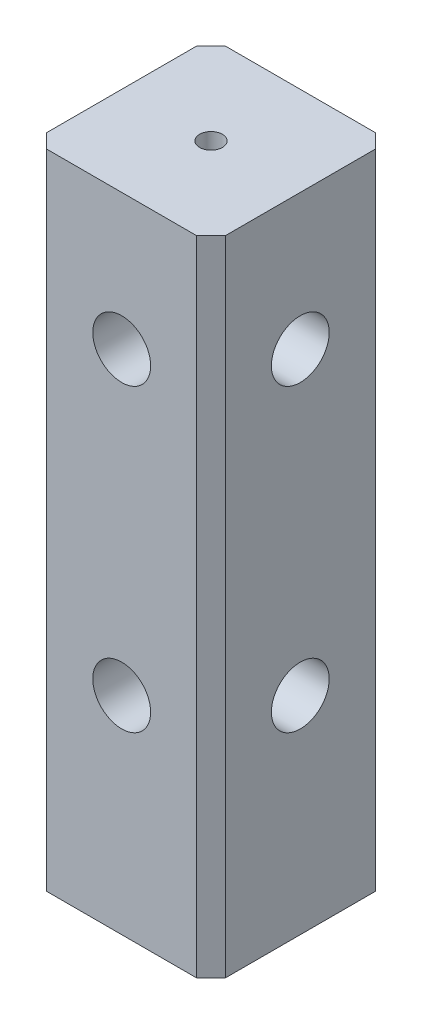
ISO-10303-21;
HEADER;
FILE_DESCRIPTION(('STEP AP214'),'2;1');
FILE_NAME('part.step','',(''),(''),'','','');
FILE_SCHEMA(('AUTOMOTIVE_DESIGN { 1 0 10303 214 1 1 1 1 }'));
ENDSEC;
DATA;
#1=APPLICATION_CONTEXT('core data for automotive mechanical design processes');
#2=APPLICATION_PROTOCOL_DEFINITION('international standard','automotive_design',2000,#1);
#3=PRODUCT_CONTEXT('',#1,'mechanical');
#4=PRODUCT('Part','Part','',(#3));
#5=PRODUCT_RELATED_PRODUCT_CATEGORY('part','',(#4));
#6=PRODUCT_DEFINITION_FORMATION('','',#4);
#7=PRODUCT_DEFINITION_CONTEXT('part definition',#1,'design');
#8=PRODUCT_DEFINITION('design','',#6,#7);
#9=PRODUCT_DEFINITION_SHAPE('','',#8);
#10=(LENGTH_UNIT() NAMED_UNIT(*) SI_UNIT(.MILLI.,.METRE.));
#11=(NAMED_UNIT(*) PLANE_ANGLE_UNIT() SI_UNIT($,.RADIAN.));
#12=(NAMED_UNIT(*) SI_UNIT($,.STERADIAN.) SOLID_ANGLE_UNIT());
#13=UNCERTAINTY_MEASURE_WITH_UNIT(LENGTH_MEASURE(1.E-05),#10,'distance_accuracy_value','');
#14=(GEOMETRIC_REPRESENTATION_CONTEXT(3) GLOBAL_UNCERTAINTY_ASSIGNED_CONTEXT((#13)) GLOBAL_UNIT_ASSIGNED_CONTEXT((#10,
#11,#12)) REPRESENTATION_CONTEXT('',''));
#15=CARTESIAN_POINT('',(0.,0.,0.));
#16=DIRECTION('',(0.,0.,1.));
#17=DIRECTION('',(1.,0.,0.));
#18=AXIS2_PLACEMENT_3D('',#15,#16,#17);
#19=CARTESIAN_POINT('',(12.5,90.,-12.5));
#20=DIRECTION('',(-1.,0.,0.));
#21=DIRECTION('',(0.,0.,1.));
#22=AXIS2_PLACEMENT_3D('',#19,#20,#21);
#23=PLANE('',#22);
#24=CARTESIAN_POINT('',(12.5,71.,0.));
#25=DIRECTION('',(1.,0.,0.));
#26=DIRECTION('',(0.,0.,-1.));
#27=AXIS2_PLACEMENT_3D('',#24,#25,#26);
#28=CIRCLE('',#27,4.05);
#29=CARTESIAN_POINT('',(12.5,71.,-4.05));
#30=VERTEX_POINT('',#29);
#31=EDGE_CURVE('E181',#30,#30,#28,.T.);
#32=ORIENTED_EDGE('',*,*,#31,.F.);
#33=EDGE_LOOP('',(#32));
#34=FACE_BOUND('',#33,.T.);
#35=CARTESIAN_POINT('',(12.5,29.,0.));
#36=DIRECTION('',(1.,0.,0.));
#37=DIRECTION('',(0.,0.,-1.));
#38=AXIS2_PLACEMENT_3D('',#35,#36,#37);
#39=CIRCLE('',#38,4.05);
#40=CARTESIAN_POINT('',(12.5,29.,-4.05));
#41=VERTEX_POINT('',#40);
#42=EDGE_CURVE('E133',#41,#41,#39,.T.);
#43=ORIENTED_EDGE('',*,*,#42,.F.);
#44=EDGE_LOOP('',(#43));
#45=FACE_BOUND('',#44,.T.);
#46=DIRECTION('',(0.,0.,-1.));
#47=VECTOR('',#46,1.);
#48=CARTESIAN_POINT('',(12.5,90.,-12.5));
#49=LINE('',#48,#47);
#50=CARTESIAN_POINT('',(12.5,90.,10.5));
#51=VERTEX_POINT('',#50);
#52=CARTESIAN_POINT('',(12.5,90.,-10.5));
#53=VERTEX_POINT('',#52);
#54=EDGE_CURVE('E120',#51,#53,#49,.T.);
#55=ORIENTED_EDGE('',*,*,#54,.F.);
#56=DIRECTION('',(0.,-1.,0.));
#57=VECTOR('',#56,1.);
#58=CARTESIAN_POINT('',(12.5,90.,10.5));
#59=LINE('',#58,#57);
#60=CARTESIAN_POINT('',(12.5,0.,10.5));
#61=VERTEX_POINT('',#60);
#62=EDGE_CURVE('E105',#51,#61,#59,.T.);
#63=ORIENTED_EDGE('',*,*,#62,.T.);
#64=DIRECTION('',(0.,0.,-1.));
#65=VECTOR('',#64,1.);
#66=CARTESIAN_POINT('',(12.5,0.,-12.5));
#67=LINE('',#66,#65);
#68=CARTESIAN_POINT('',(12.5,0.,-10.5));
#69=VERTEX_POINT('',#68);
#70=EDGE_CURVE('E117',#61,#69,#67,.T.);
#71=ORIENTED_EDGE('',*,*,#70,.T.);
#72=DIRECTION('',(0.,1.,0.));
#73=VECTOR('',#72,1.);
#74=CARTESIAN_POINT('',(12.5,90.,-10.5));
#75=LINE('',#74,#73);
#76=EDGE_CURVE('E122',#69,#53,#75,.T.);
#77=ORIENTED_EDGE('',*,*,#76,.T.);
#78=EDGE_LOOP('',(#55,#63,#71,#77));
#79=FACE_BOUND('',#78,.T.);
#80=ADVANCED_FACE('F35',(#34,#45,#79),#23,.F.);
#81=CARTESIAN_POINT('',(12.5,90.,-12.5));
#82=DIRECTION('',(0.,0.,1.));
#83=DIRECTION('',(1.,0.,0.));
#84=AXIS2_PLACEMENT_3D('',#81,#82,#83);
#85=PLANE('',#84);
#86=DIRECTION('',(-1.,0.,0.));
#87=VECTOR('',#86,1.);
#88=CARTESIAN_POINT('',(12.5,90.,-12.5));
#89=LINE('',#88,#87);
#90=CARTESIAN_POINT('',(10.5,90.,-12.5));
#91=VERTEX_POINT('',#90);
#92=CARTESIAN_POINT('',(-10.5,90.,-12.5));
#93=VERTEX_POINT('',#92);
#94=EDGE_CURVE('E166',#91,#93,#89,.T.);
#95=ORIENTED_EDGE('',*,*,#94,.F.);
#96=DIRECTION('',(0.,-1.,0.));
#97=VECTOR('',#96,1.);
#98=CARTESIAN_POINT('',(10.5,90.,-12.5));
#99=LINE('',#98,#97);
#100=CARTESIAN_POINT('',(10.5,0.,-12.5));
#101=VERTEX_POINT('',#100);
#102=EDGE_CURVE('E159',#91,#101,#99,.T.);
#103=ORIENTED_EDGE('',*,*,#102,.T.);
#104=DIRECTION('',(-1.,0.,0.));
#105=VECTOR('',#104,1.);
#106=CARTESIAN_POINT('',(12.5,0.,-12.5));
#107=LINE('',#106,#105);
#108=CARTESIAN_POINT('',(-10.5,0.,-12.5));
#109=VERTEX_POINT('',#108);
#110=EDGE_CURVE('E126',#101,#109,#107,.T.);
#111=ORIENTED_EDGE('',*,*,#110,.T.);
#112=DIRECTION('',(0.,1.,0.));
#113=VECTOR('',#112,1.);
#114=CARTESIAN_POINT('',(-10.5,90.,-12.5));
#115=LINE('',#114,#113);
#116=EDGE_CURVE('E157',#109,#93,#115,.T.);
#117=ORIENTED_EDGE('',*,*,#116,.T.);
#118=EDGE_LOOP('',(#95,#103,#111,#117));
#119=FACE_BOUND('',#118,.T.);
#120=ADVANCED_FACE('F164',(#119),#85,.F.);
#121=CARTESIAN_POINT('',(-12.5,90.,-12.5));
#122=DIRECTION('',(1.,0.,0.));
#123=DIRECTION('',(0.,0.,-1.));
#124=AXIS2_PLACEMENT_3D('',#121,#122,#123);
#125=PLANE('',#124);
#126=DIRECTION('',(0.,0.,1.));
#127=VECTOR('',#126,1.);
#128=CARTESIAN_POINT('',(-12.5,90.,-12.5));
#129=LINE('',#128,#127);
#130=CARTESIAN_POINT('',(-12.5,90.,-10.5));
#131=VERTEX_POINT('',#130);
#132=CARTESIAN_POINT('',(-12.5,90.,10.5));
#133=VERTEX_POINT('',#132);
#134=EDGE_CURVE('E174',#131,#133,#129,.T.);
#135=ORIENTED_EDGE('',*,*,#134,.F.);
#136=DIRECTION('',(0.,-1.,0.));
#137=VECTOR('',#136,1.);
#138=CARTESIAN_POINT('',(-12.5,90.,-10.5));
#139=LINE('',#138,#137);
#140=CARTESIAN_POINT('',(-12.5,0.,-10.5));
#141=VERTEX_POINT('',#140);
#142=EDGE_CURVE('E11',#131,#141,#139,.T.);
#143=ORIENTED_EDGE('',*,*,#142,.T.);
#144=DIRECTION('',(0.,0.,1.));
#145=VECTOR('',#144,1.);
#146=CARTESIAN_POINT('',(-12.5,0.,-12.5));
#147=LINE('',#146,#145);
#148=CARTESIAN_POINT('',(-12.5,0.,10.5));
#149=VERTEX_POINT('',#148);
#150=EDGE_CURVE('E130',#141,#149,#147,.T.);
#151=ORIENTED_EDGE('',*,*,#150,.T.);
#152=DIRECTION('',(0.,1.,0.));
#153=VECTOR('',#152,1.);
#154=CARTESIAN_POINT('',(-12.5,90.,10.5));
#155=LINE('',#154,#153);
#156=EDGE_CURVE('E43',#149,#133,#155,.T.);
#157=ORIENTED_EDGE('',*,*,#156,.T.);
#158=EDGE_LOOP('',(#135,#143,#151,#157));
#159=FACE_BOUND('',#158,.T.);
#160=ADVANCED_FACE('F173',(#159),#125,.F.);
#161=CARTESIAN_POINT('',(12.5,90.,12.5));
#162=DIRECTION('',(0.,0.,-1.));
#163=DIRECTION('',(-1.,0.,0.));
#164=AXIS2_PLACEMENT_3D('',#161,#162,#163);
#165=PLANE('',#164);
#166=CARTESIAN_POINT('',(0.,71.,12.5));
#167=DIRECTION('',(0.,0.,1.));
#168=DIRECTION('',(1.,0.,0.));
#169=AXIS2_PLACEMENT_3D('',#166,#167,#168);
#170=CIRCLE('',#169,4.05);
#171=CARTESIAN_POINT('',(4.05,71.,12.5));
#172=VERTEX_POINT('',#171);
#173=EDGE_CURVE('E192',#172,#172,#170,.T.);
#174=ORIENTED_EDGE('',*,*,#173,.F.);
#175=EDGE_LOOP('',(#174));
#176=FACE_BOUND('',#175,.T.);
#177=CARTESIAN_POINT('',(0.,29.,12.5));
#178=DIRECTION('',(0.,0.,1.));
#179=DIRECTION('',(1.,0.,0.));
#180=AXIS2_PLACEMENT_3D('',#177,#178,#179);
#181=CIRCLE('',#180,4.05);
#182=CARTESIAN_POINT('',(4.05,29.,12.5));
#183=VERTEX_POINT('',#182);
#184=EDGE_CURVE('E189',#183,#183,#181,.T.);
#185=ORIENTED_EDGE('',*,*,#184,.F.);
#186=EDGE_LOOP('',(#185));
#187=FACE_BOUND('',#186,.T.);
#188=DIRECTION('',(1.,0.,0.));
#189=VECTOR('',#188,1.);
#190=CARTESIAN_POINT('',(12.5,0.,12.5));
#191=LINE('',#190,#189);
#192=CARTESIAN_POINT('',(-10.5,0.,12.5));
#193=VERTEX_POINT('',#192);
#194=CARTESIAN_POINT('',(10.5,0.,12.5));
#195=VERTEX_POINT('',#194);
#196=EDGE_CURVE('E140',#193,#195,#191,.T.);
#197=ORIENTED_EDGE('',*,*,#196,.T.);
#198=DIRECTION('',(0.,1.,0.));
#199=VECTOR('',#198,1.);
#200=CARTESIAN_POINT('',(10.5,90.,12.5));
#201=LINE('',#200,#199);
#202=CARTESIAN_POINT('',(10.5,90.,12.5));
#203=VERTEX_POINT('',#202);
#204=EDGE_CURVE('E106',#195,#203,#201,.T.);
#205=ORIENTED_EDGE('',*,*,#204,.T.);
#206=DIRECTION('',(1.,0.,0.));
#207=VECTOR('',#206,1.);
#208=CARTESIAN_POINT('',(12.5,90.,12.5));
#209=LINE('',#208,#207);
#210=CARTESIAN_POINT('',(-10.5,90.,12.5));
#211=VERTEX_POINT('',#210);
#212=EDGE_CURVE('E136',#211,#203,#209,.T.);
#213=ORIENTED_EDGE('',*,*,#212,.F.);
#214=DIRECTION('',(0.,-1.,0.));
#215=VECTOR('',#214,1.);
#216=CARTESIAN_POINT('',(-10.5,90.,12.5));
#217=LINE('',#216,#215);
#218=EDGE_CURVE('E111',#211,#193,#217,.T.);
#219=ORIENTED_EDGE('',*,*,#218,.T.);
#220=EDGE_LOOP('',(#197,#205,#213,#219));
#221=FACE_BOUND('',#220,.T.);
#222=ADVANCED_FACE('F217',(#176,#187,#221),#165,.F.);
#223=CARTESIAN_POINT('',(12.5,90.,12.5));
#224=DIRECTION('',(0.,-1.,0.));
#225=DIRECTION('',(0.,0.,-1.));
#226=AXIS2_PLACEMENT_3D('',#223,#224,#225);
#227=PLANE('',#226);
#228=CARTESIAN_POINT('',(0.,90.,0.));
#229=DIRECTION('',(0.,1.,0.));
#230=DIRECTION('',(0.,0.,1.));
#231=AXIS2_PLACEMENT_3D('',#228,#229,#230);
#232=CIRCLE('',#231,1.6);
#233=CARTESIAN_POINT('',(0.,90.,1.6));
#234=VERTEX_POINT('',#233);
#235=EDGE_CURVE('E201',#234,#234,#232,.T.);
#236=ORIENTED_EDGE('',*,*,#235,.F.);
#237=EDGE_LOOP('',(#236));
#238=FACE_BOUND('',#237,.T.);
#239=ORIENTED_EDGE('',*,*,#212,.T.);
#240=DIRECTION('',(-0.70710678118655,0.,0.707106781186545));
#241=VECTOR('',#240,1.);
#242=CARTESIAN_POINT('',(12.5,90.,10.5));
#243=LINE('',#242,#241);
#244=EDGE_CURVE('E155',#203,#51,#243,.F.);
#245=ORIENTED_EDGE('',*,*,#244,.T.);
#246=ORIENTED_EDGE('',*,*,#54,.T.);
#247=DIRECTION('',(0.707106781186545,0.,0.70710678118655));
#248=VECTOR('',#247,1.);
#249=CARTESIAN_POINT('',(10.5,90.,-12.5));
#250=LINE('',#249,#248);
#251=EDGE_CURVE('E153',#53,#91,#250,.F.);
#252=ORIENTED_EDGE('',*,*,#251,.T.);
#253=ORIENTED_EDGE('',*,*,#94,.T.);
#254=DIRECTION('',(0.707106781186551,0.,-0.707106781186544));
#255=VECTOR('',#254,1.);
#256=CARTESIAN_POINT('',(-12.5,90.,-10.5));
#257=LINE('',#256,#255);
#258=EDGE_CURVE('E56',#93,#131,#257,.F.);
#259=ORIENTED_EDGE('',*,*,#258,.T.);
#260=ORIENTED_EDGE('',*,*,#134,.T.);
#261=DIRECTION('',(-0.707106781186545,0.,-0.70710678118655));
#262=VECTOR('',#261,1.);
#263=CARTESIAN_POINT('',(-10.5,90.,12.5));
#264=LINE('',#263,#262);
#265=EDGE_CURVE('E150',#133,#211,#264,.F.);
#266=ORIENTED_EDGE('',*,*,#265,.T.);
#267=EDGE_LOOP('',(#239,#245,#246,#252,#253,#259,#260,#266));
#268=FACE_BOUND('',#267,.T.);
#269=ADVANCED_FACE('F215',(#238,#268),#227,.F.);
#270=CARTESIAN_POINT('',(12.5,0.,12.5));
#271=DIRECTION('',(0.,-1.,0.));
#272=DIRECTION('',(0.,0.,-1.));
#273=AXIS2_PLACEMENT_3D('',#270,#271,#272);
#274=PLANE('',#273);
#275=ORIENTED_EDGE('',*,*,#70,.F.);
#276=DIRECTION('',(0.70710678118655,0.,-0.707106781186545));
#277=VECTOR('',#276,1.);
#278=CARTESIAN_POINT('',(11.5,0.,11.5));
#279=LINE('',#278,#277);
#280=EDGE_CURVE('E101',#61,#195,#279,.F.);
#281=ORIENTED_EDGE('',*,*,#280,.T.);
#282=ORIENTED_EDGE('',*,*,#196,.F.);
#283=DIRECTION('',(0.707106781186545,0.,0.70710678118655));
#284=VECTOR('',#283,1.);
#285=CARTESIAN_POINT('',(0.999999999999912,0.,24.));
#286=LINE('',#285,#284);
#287=EDGE_CURVE('E121',#193,#149,#286,.F.);
#288=ORIENTED_EDGE('',*,*,#287,.T.);
#289=ORIENTED_EDGE('',*,*,#150,.F.);
#290=DIRECTION('',(-0.707106781186551,0.,0.707106781186544));
#291=VECTOR('',#290,1.);
#292=CARTESIAN_POINT('',(-11.4999999999999,0.,-11.5000000000001));
#293=LINE('',#292,#291);
#294=EDGE_CURVE('E144',#141,#109,#293,.F.);
#295=ORIENTED_EDGE('',*,*,#294,.T.);
#296=ORIENTED_EDGE('',*,*,#110,.F.);
#297=DIRECTION('',(-0.707106781186545,0.,-0.70710678118655));
#298=VECTOR('',#297,1.);
#299=CARTESIAN_POINT('',(24.,0.,1.00000000000007));
#300=LINE('',#299,#298);
#301=EDGE_CURVE('E112',#101,#69,#300,.F.);
#302=ORIENTED_EDGE('',*,*,#301,.T.);
#303=EDGE_LOOP('',(#275,#281,#282,#288,#289,#295,#296,#302));
#304=FACE_BOUND('',#303,.T.);
#305=ADVANCED_FACE('F124',(#304),#274,.T.);
#306=CARTESIAN_POINT('',(4.5,29.,0.));
#307=DIRECTION('',(1.,0.,0.));
#308=DIRECTION('',(0.,0.,-1.));
#309=AXIS2_PLACEMENT_3D('',#306,#307,#308);
#310=CYLINDRICAL_SURFACE('',#309,4.05);
#311=CARTESIAN_POINT('',(4.5,29.,0.));
#312=DIRECTION('',(1.,0.,0.));
#313=DIRECTION('',(0.,0.,-1.));
#314=AXIS2_PLACEMENT_3D('',#311,#312,#313);
#315=CIRCLE('',#314,4.05);
#316=CARTESIAN_POINT('',(4.5,29.,-4.05));
#317=VERTEX_POINT('',#316);
#318=EDGE_CURVE('E127',#317,#317,#315,.T.);
#319=ORIENTED_EDGE('',*,*,#318,.F.);
#320=EDGE_LOOP('',(#319));
#321=FACE_BOUND('',#320,.T.);
#322=ORIENTED_EDGE('',*,*,#42,.T.);
#323=EDGE_LOOP('',(#322));
#324=FACE_BOUND('',#323,.T.);
#325=ADVANCED_FACE('F311',(#321,#324),#310,.F.);
#326=CARTESIAN_POINT('',(4.5,29.,0.));
#327=DIRECTION('',(1.,0.,0.));
#328=DIRECTION('',(0.,0.,-1.));
#329=AXIS2_PLACEMENT_3D('',#326,#327,#328);
#330=PLANE('',#329);
#331=ORIENTED_EDGE('',*,*,#318,.T.);
#332=EDGE_LOOP('',(#331));
#333=FACE_BOUND('',#332,.T.);
#334=ADVANCED_FACE('F304',(#333),#330,.T.);
#335=CARTESIAN_POINT('',(4.5,71.,0.));
#336=DIRECTION('',(1.,0.,0.));
#337=DIRECTION('',(0.,0.,-1.));
#338=AXIS2_PLACEMENT_3D('',#335,#336,#337);
#339=CYLINDRICAL_SURFACE('',#338,4.05);
#340=CARTESIAN_POINT('',(4.5,71.,0.));
#341=DIRECTION('',(1.,0.,0.));
#342=DIRECTION('',(0.,0.,-1.));
#343=AXIS2_PLACEMENT_3D('',#340,#341,#342);
#344=CIRCLE('',#343,4.05);
#345=CARTESIAN_POINT('',(4.5,71.,-4.04999999999999));
#346=VERTEX_POINT('',#345);
#347=EDGE_CURVE('E183',#346,#346,#344,.T.);
#348=ORIENTED_EDGE('',*,*,#347,.F.);
#349=EDGE_LOOP('',(#348));
#350=FACE_BOUND('',#349,.T.);
#351=ORIENTED_EDGE('',*,*,#31,.T.);
#352=EDGE_LOOP('',(#351));
#353=FACE_BOUND('',#352,.T.);
#354=ADVANCED_FACE('F301',(#350,#353),#339,.F.);
#355=CARTESIAN_POINT('',(4.5,71.,0.));
#356=DIRECTION('',(1.,0.,0.));
#357=DIRECTION('',(0.,0.,-1.));
#358=AXIS2_PLACEMENT_3D('',#355,#356,#357);
#359=PLANE('',#358);
#360=ORIENTED_EDGE('',*,*,#347,.T.);
#361=EDGE_LOOP('',(#360));
#362=FACE_BOUND('',#361,.T.);
#363=ADVANCED_FACE('F299',(#362),#359,.T.);
#364=CARTESIAN_POINT('',(0.,29.,4.5));
#365=DIRECTION('',(0.,0.,1.));
#366=DIRECTION('',(1.,0.,0.));
#367=AXIS2_PLACEMENT_3D('',#364,#365,#366);
#368=CYLINDRICAL_SURFACE('',#367,4.05);
#369=CARTESIAN_POINT('',(0.,29.,4.5));
#370=DIRECTION('',(0.,0.,1.));
#371=DIRECTION('',(1.,0.,0.));
#372=AXIS2_PLACEMENT_3D('',#369,#370,#371);
#373=CIRCLE('',#372,4.05);
#374=CARTESIAN_POINT('',(4.05,29.,4.5));
#375=VERTEX_POINT('',#374);
#376=EDGE_CURVE('E186',#375,#375,#373,.T.);
#377=ORIENTED_EDGE('',*,*,#376,.F.);
#378=EDGE_LOOP('',(#377));
#379=FACE_BOUND('',#378,.T.);
#380=ORIENTED_EDGE('',*,*,#184,.T.);
#381=EDGE_LOOP('',(#380));
#382=FACE_BOUND('',#381,.T.);
#383=ADVANCED_FACE('F295',(#379,#382),#368,.F.);
#384=CARTESIAN_POINT('',(0.,29.,4.5));
#385=DIRECTION('',(0.,0.,1.));
#386=DIRECTION('',(1.,0.,0.));
#387=AXIS2_PLACEMENT_3D('',#384,#385,#386);
#388=PLANE('',#387);
#389=ORIENTED_EDGE('',*,*,#376,.T.);
#390=EDGE_LOOP('',(#389));
#391=FACE_BOUND('',#390,.T.);
#392=ADVANCED_FACE('F289',(#391),#388,.T.);
#393=CARTESIAN_POINT('',(0.,71.,4.5));
#394=DIRECTION('',(0.,0.,1.));
#395=DIRECTION('',(1.,0.,0.));
#396=AXIS2_PLACEMENT_3D('',#393,#394,#395);
#397=CYLINDRICAL_SURFACE('',#396,4.05);
#398=CARTESIAN_POINT('',(0.,71.,4.5));
#399=DIRECTION('',(0.,0.,1.));
#400=DIRECTION('',(1.,0.,0.));
#401=AXIS2_PLACEMENT_3D('',#398,#399,#400);
#402=CIRCLE('',#401,4.05);
#403=CARTESIAN_POINT('',(4.05,71.,4.5));
#404=VERTEX_POINT('',#403);
#405=EDGE_CURVE('E195',#404,#404,#402,.T.);
#406=ORIENTED_EDGE('',*,*,#405,.F.);
#407=EDGE_LOOP('',(#406));
#408=FACE_BOUND('',#407,.T.);
#409=ORIENTED_EDGE('',*,*,#173,.T.);
#410=EDGE_LOOP('',(#409));
#411=FACE_BOUND('',#410,.T.);
#412=ADVANCED_FACE('F286',(#408,#411),#397,.F.);
#413=CARTESIAN_POINT('',(0.,71.,4.5));
#414=DIRECTION('',(0.,0.,1.));
#415=DIRECTION('',(1.,0.,0.));
#416=AXIS2_PLACEMENT_3D('',#413,#414,#415);
#417=PLANE('',#416);
#418=ORIENTED_EDGE('',*,*,#405,.T.);
#419=EDGE_LOOP('',(#418));
#420=FACE_BOUND('',#419,.T.);
#421=ADVANCED_FACE('F241',(#420),#417,.T.);
#422=CARTESIAN_POINT('',(12.5,90.,10.5));
#423=DIRECTION('',(-0.707106781186545,0.,-0.70710678118655));
#424=DIRECTION('',(-0.70710678118655,0.,0.707106781186545));
#425=AXIS2_PLACEMENT_3D('',#422,#423,#424);
#426=PLANE('',#425);
#427=ORIENTED_EDGE('',*,*,#244,.F.);
#428=ORIENTED_EDGE('',*,*,#204,.F.);
#429=ORIENTED_EDGE('',*,*,#280,.F.);
#430=ORIENTED_EDGE('',*,*,#62,.F.);
#431=EDGE_LOOP('',(#427,#428,#429,#430));
#432=FACE_BOUND('',#431,.T.);
#433=ADVANCED_FACE('F104',(#432),#426,.F.);
#434=CARTESIAN_POINT('',(10.5,90.,-12.5));
#435=DIRECTION('',(-0.70710678118655,0.,0.707106781186545));
#436=DIRECTION('',(0.707106781186545,0.,0.70710678118655));
#437=AXIS2_PLACEMENT_3D('',#434,#435,#436);
#438=PLANE('',#437);
#439=ORIENTED_EDGE('',*,*,#251,.F.);
#440=ORIENTED_EDGE('',*,*,#76,.F.);
#441=ORIENTED_EDGE('',*,*,#301,.F.);
#442=ORIENTED_EDGE('',*,*,#102,.F.);
#443=EDGE_LOOP('',(#439,#440,#441,#442));
#444=FACE_BOUND('',#443,.T.);
#445=ADVANCED_FACE('F227',(#444),#438,.F.);
#446=CARTESIAN_POINT('',(-12.5,90.,-10.5));
#447=DIRECTION('',(0.707106781186544,0.,0.707106781186551));
#448=DIRECTION('',(0.707106781186551,0.,-0.707106781186544));
#449=AXIS2_PLACEMENT_3D('',#446,#447,#448);
#450=PLANE('',#449);
#451=ORIENTED_EDGE('',*,*,#258,.F.);
#452=ORIENTED_EDGE('',*,*,#116,.F.);
#453=ORIENTED_EDGE('',*,*,#294,.F.);
#454=ORIENTED_EDGE('',*,*,#142,.F.);
#455=EDGE_LOOP('',(#451,#452,#453,#454));
#456=FACE_BOUND('',#455,.T.);
#457=ADVANCED_FACE('F172',(#456),#450,.F.);
#458=CARTESIAN_POINT('',(-10.5,90.,12.5));
#459=DIRECTION('',(0.70710678118655,0.,-0.707106781186545));
#460=DIRECTION('',(-0.707106781186545,0.,-0.70710678118655));
#461=AXIS2_PLACEMENT_3D('',#458,#459,#460);
#462=PLANE('',#461);
#463=ORIENTED_EDGE('',*,*,#265,.F.);
#464=ORIENTED_EDGE('',*,*,#156,.F.);
#465=ORIENTED_EDGE('',*,*,#287,.F.);
#466=ORIENTED_EDGE('',*,*,#218,.F.);
#467=EDGE_LOOP('',(#463,#464,#465,#466));
#468=FACE_BOUND('',#467,.T.);
#469=ADVANCED_FACE('F37',(#468),#462,.F.);
#470=CARTESIAN_POINT('',(0.,80.,0.));
#471=DIRECTION('',(0.,1.,0.));
#472=DIRECTION('',(0.,0.,1.));
#473=AXIS2_PLACEMENT_3D('',#470,#471,#472);
#474=CYLINDRICAL_SURFACE('',#473,1.6);
#475=CARTESIAN_POINT('',(0.,80.,0.));
#476=DIRECTION('',(0.,1.,0.));
#477=DIRECTION('',(0.,0.,1.));
#478=AXIS2_PLACEMENT_3D('',#475,#476,#477);
#479=CIRCLE('',#478,1.6);
#480=CARTESIAN_POINT('',(0.,80.,1.6));
#481=VERTEX_POINT('',#480);
#482=EDGE_CURVE('E198',#481,#481,#479,.T.);
#483=ORIENTED_EDGE('',*,*,#482,.F.);
#484=EDGE_LOOP('',(#483));
#485=FACE_BOUND('',#484,.T.);
#486=ORIENTED_EDGE('',*,*,#235,.T.);
#487=EDGE_LOOP('',(#486));
#488=FACE_BOUND('',#487,.T.);
#489=ADVANCED_FACE('F209',(#485,#488),#474,.F.);
#490=CARTESIAN_POINT('',(0.,80.,0.));
#491=DIRECTION('',(0.,1.,0.));
#492=DIRECTION('',(0.,0.,1.));
#493=AXIS2_PLACEMENT_3D('',#490,#491,#492);
#494=PLANE('',#493);
#495=ORIENTED_EDGE('',*,*,#482,.T.);
#496=EDGE_LOOP('',(#495));
#497=FACE_BOUND('',#496,.T.);
#498=ADVANCED_FACE('F207',(#497),#494,.T.);
#499=CLOSED_SHELL('',(#80,#120,#160,#222,#269,#305,#325,#334,#354,#363,#383,#392,#412,#421,#433,
#445,#457,#469,#489,#498));
#500=MANIFOLD_SOLID_BREP('B2',#499);
#501=ADVANCED_BREP_SHAPE_REPRESENTATION('',(#18,#500),#14);
#502=SHAPE_DEFINITION_REPRESENTATION(#9,#501);
ENDSEC;
END-ISO-10303-21;
